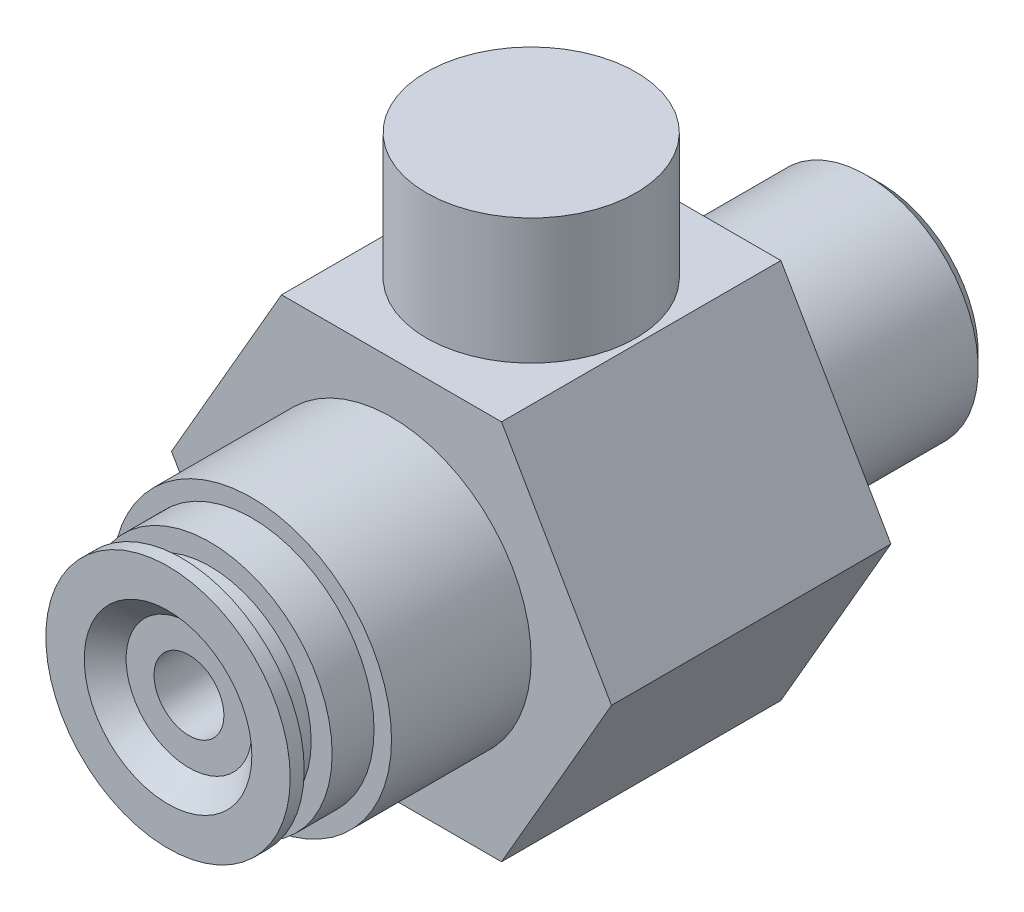
ISO-10303-21;
HEADER;
FILE_DESCRIPTION(('STEP AP214'),'2;1');
FILE_NAME('part.step','',(''),(''),'','','');
FILE_SCHEMA(('AUTOMOTIVE_DESIGN { 1 0 10303 214 1 1 1 1 }'));
ENDSEC;
DATA;
#1=APPLICATION_CONTEXT('core data for automotive mechanical design processes');
#2=APPLICATION_PROTOCOL_DEFINITION('international standard','automotive_design',2000,#1);
#3=PRODUCT_CONTEXT('',#1,'mechanical');
#4=PRODUCT('Part','Part','',(#3));
#5=PRODUCT_RELATED_PRODUCT_CATEGORY('part','',(#4));
#6=PRODUCT_DEFINITION_FORMATION('','',#4);
#7=PRODUCT_DEFINITION_CONTEXT('part definition',#1,'design');
#8=PRODUCT_DEFINITION('design','',#6,#7);
#9=PRODUCT_DEFINITION_SHAPE('','',#8);
#10=(LENGTH_UNIT() NAMED_UNIT(*) SI_UNIT(.MILLI.,.METRE.));
#11=(NAMED_UNIT(*) PLANE_ANGLE_UNIT() SI_UNIT($,.RADIAN.));
#12=(NAMED_UNIT(*) SI_UNIT($,.STERADIAN.) SOLID_ANGLE_UNIT());
#13=UNCERTAINTY_MEASURE_WITH_UNIT(LENGTH_MEASURE(1.E-05),#10,'distance_accuracy_value','');
#14=(GEOMETRIC_REPRESENTATION_CONTEXT(3) GLOBAL_UNCERTAINTY_ASSIGNED_CONTEXT((#13)) GLOBAL_UNIT_ASSIGNED_CONTEXT((#10,
#11,#12)) REPRESENTATION_CONTEXT('',''));
#15=CARTESIAN_POINT('',(0.,0.,0.));
#16=DIRECTION('',(0.,0.,1.));
#17=DIRECTION('',(1.,0.,0.));
#18=AXIS2_PLACEMENT_3D('',#15,#16,#17);
#19=CARTESIAN_POINT('',(0.,-17.6399001096049,10.));
#20=DIRECTION('',(0.,1.,0.));
#21=DIRECTION('',(-1.,0.,0.));
#22=AXIS2_PLACEMENT_3D('',#19,#20,#21);
#23=CYLINDRICAL_SURFACE('',#22,4.);
#24=CARTESIAN_POINT('',(0.,-17.6399001096049,10.));
#25=DIRECTION('',(0.,-1.,0.));
#26=DIRECTION('',(1.,0.,0.));
#27=AXIS2_PLACEMENT_3D('',#24,#25,#26);
#28=CIRCLE('',#27,4.);
#29=CARTESIAN_POINT('',(-2.99999999999993,-17.6399001096049,7.35424868893541));
#30=VERTEX_POINT('',#29);
#31=CARTESIAN_POINT('',(3.00000000000007,-17.6399001096049,7.35424868893541));
#32=VERTEX_POINT('',#31);
#33=EDGE_CURVE('E128',#30,#32,#28,.T.);
#34=ORIENTED_EDGE('',*,*,#33,.F.);
#35=DIRECTION('',(0.,-1.,0.));
#36=VECTOR('',#35,1.);
#37=CARTESIAN_POINT('',(-2.99999999999995,-13.6399001096049,7.35424868893541));
#38=LINE('',#37,#36);
#39=CARTESIAN_POINT('',(-2.99999999999995,-13.6399001096049,7.35424868893541));
#40=VERTEX_POINT('',#39);
#41=EDGE_CURVE('E52',#40,#30,#38,.T.);
#42=ORIENTED_EDGE('',*,*,#41,.F.);
#43=CARTESIAN_POINT('',(0.,-13.6399001096049,10.));
#44=DIRECTION('',(0.,-1.,0.));
#45=DIRECTION('',(1.,0.,0.));
#46=AXIS2_PLACEMENT_3D('',#43,#44,#45);
#47=CIRCLE('',#46,4.);
#48=CARTESIAN_POINT('',(3.00000000000005,-13.6399001096049,7.35424868893541));
#49=VERTEX_POINT('',#48);
#50=EDGE_CURVE('E126',#40,#49,#47,.T.);
#51=ORIENTED_EDGE('',*,*,#50,.T.);
#52=DIRECTION('',(0.,-1.,0.));
#53=VECTOR('',#52,1.);
#54=CARTESIAN_POINT('',(3.00000000000005,-13.6399001096049,7.35424868893541));
#55=LINE('',#54,#53);
#56=EDGE_CURVE('E529',#49,#32,#55,.T.);
#57=ORIENTED_EDGE('',*,*,#56,.T.);
#58=EDGE_LOOP('',(#34,#42,#51,#57));
#59=FACE_BOUND('',#58,.T.);
#60=ADVANCED_FACE('F37',(#59),#23,.T.);
#61=CARTESIAN_POINT('',(3.00000000000005,-13.6399001096049,12.6457513110646));
#62=VERTEX_POINT('',#61);
#63=CARTESIAN_POINT('',(-2.99999999999995,-13.6399001096049,12.6457513110646));
#64=VERTEX_POINT('',#63);
#65=EDGE_CURVE('E134',#62,#64,#47,.T.);
#66=ORIENTED_EDGE('',*,*,#65,.T.);
#67=DIRECTION('',(0.,-1.,0.));
#68=VECTOR('',#67,1.);
#69=CARTESIAN_POINT('',(-2.99999999999995,-13.6399001096049,12.6457513110646));
#70=LINE('',#69,#68);
#71=CARTESIAN_POINT('',(-2.99999999999993,-17.6399001096049,12.6457513110646));
#72=VERTEX_POINT('',#71);
#73=EDGE_CURVE('E115',#64,#72,#70,.T.);
#74=ORIENTED_EDGE('',*,*,#73,.T.);
#75=CARTESIAN_POINT('',(3.00000000000007,-17.6399001096049,12.6457513110646));
#76=VERTEX_POINT('',#75);
#77=EDGE_CURVE('E143',#76,#72,#28,.T.);
#78=ORIENTED_EDGE('',*,*,#77,.F.);
#79=DIRECTION('',(0.,-1.,0.));
#80=VECTOR('',#79,1.);
#81=CARTESIAN_POINT('',(3.00000000000005,-13.6399001096049,12.6457513110646));
#82=LINE('',#81,#80);
#83=EDGE_CURVE('E60',#62,#76,#82,.T.);
#84=ORIENTED_EDGE('',*,*,#83,.F.);
#85=EDGE_LOOP('',(#66,#74,#78,#84));
#86=FACE_BOUND('',#85,.T.);
#87=ADVANCED_FACE('F242',(#86),#23,.T.);
#88=CARTESIAN_POINT('',(0.,-17.6399001096049,10.));
#89=DIRECTION('',(0.,-1.,0.));
#90=DIRECTION('',(1.,0.,0.));
#91=AXIS2_PLACEMENT_3D('',#88,#89,#90);
#92=PLANE('',#91);
#93=DIRECTION('',(0.,0.,1.));
#94=VECTOR('',#93,1.);
#95=CARTESIAN_POINT('',(-2.99999999999993,-17.6399001096049,0.));
#96=LINE('',#95,#94);
#97=EDGE_CURVE('E120',#30,#72,#96,.T.);
#98=ORIENTED_EDGE('',*,*,#97,.F.);
#99=ORIENTED_EDGE('',*,*,#33,.T.);
#100=DIRECTION('',(0.,0.,1.));
#101=VECTOR('',#100,1.);
#102=CARTESIAN_POINT('',(3.00000000000007,-17.6399001096049,0.));
#103=LINE('',#102,#101);
#104=EDGE_CURVE('E535',#32,#76,#103,.T.);
#105=ORIENTED_EDGE('',*,*,#104,.T.);
#106=ORIENTED_EDGE('',*,*,#77,.T.);
#107=EDGE_LOOP('',(#98,#99,#105,#106));
#108=FACE_BOUND('',#107,.T.);
#109=ADVANCED_FACE('F247',(#108),#92,.T.);
#110=CARTESIAN_POINT('',(0.,0.,36.));
#111=DIRECTION('',(0.,0.,-1.));
#112=DIRECTION('',(-1.,0.,0.));
#113=AXIS2_PLACEMENT_3D('',#110,#111,#112);
#114=CYLINDRICAL_SURFACE('',#113,8.75);
#115=CARTESIAN_POINT('',(0.,0.,36.));
#116=DIRECTION('',(0.,0.,1.));
#117=DIRECTION('',(1.,0.,0.));
#118=AXIS2_PLACEMENT_3D('',#115,#116,#117);
#119=CIRCLE('',#118,8.75);
#120=CARTESIAN_POINT('',(8.75,0.,36.));
#121=VERTEX_POINT('',#120);
#122=EDGE_CURVE('E169',#121,#121,#119,.T.);
#123=ORIENTED_EDGE('',*,*,#122,.F.);
#124=EDGE_LOOP('',(#123));
#125=FACE_BOUND('',#124,.T.);
#126=CARTESIAN_POINT('',(0.,0.,35.));
#127=DIRECTION('',(0.,0.,1.));
#128=DIRECTION('',(1.,0.,0.));
#129=AXIS2_PLACEMENT_3D('',#126,#127,#128);
#130=CIRCLE('',#129,8.75);
#131=CARTESIAN_POINT('',(8.75,0.,35.));
#132=VERTEX_POINT('',#131);
#133=EDGE_CURVE('E154',#132,#132,#130,.T.);
#134=ORIENTED_EDGE('',*,*,#133,.T.);
#135=EDGE_LOOP('',(#134));
#136=FACE_BOUND('',#135,.T.);
#137=ADVANCED_FACE('F283',(#125,#136),#114,.T.);
#138=CARTESIAN_POINT('',(0.,0.,36.));
#139=DIRECTION('',(0.,0.,1.));
#140=DIRECTION('',(1.,0.,0.));
#141=AXIS2_PLACEMENT_3D('',#138,#139,#140);
#142=PLANE('',#141);
#143=CARTESIAN_POINT('',(0.,0.,36.));
#144=DIRECTION('',(0.,0.,1.));
#145=DIRECTION('',(1.,0.,0.));
#146=AXIS2_PLACEMENT_3D('',#143,#144,#145);
#147=CIRCLE('',#146,6.);
#148=CARTESIAN_POINT('',(6.,0.,36.));
#149=VERTEX_POINT('',#148);
#150=EDGE_CURVE('E166',#149,#149,#147,.T.);
#151=ORIENTED_EDGE('',*,*,#150,.F.);
#152=EDGE_LOOP('',(#151));
#153=FACE_BOUND('',#152,.T.);
#154=ORIENTED_EDGE('',*,*,#122,.T.);
#155=EDGE_LOOP('',(#154));
#156=FACE_BOUND('',#155,.T.);
#157=ADVANCED_FACE('F279',(#153,#156),#142,.T.);
#158=CARTESIAN_POINT('',(0.,0.,34.5));
#159=DIRECTION('',(0.,0.,1.));
#160=DIRECTION('',(1.,0.,0.));
#161=AXIS2_PLACEMENT_3D('',#158,#159,#160);
#162=CONICAL_SURFACE('',#161,4.5,0.785398163397449);
#163=ORIENTED_EDGE('',*,*,#150,.T.);
#164=EDGE_LOOP('',(#163));
#165=FACE_BOUND('',#164,.T.);
#166=CARTESIAN_POINT('',(0.,0.,34.5));
#167=DIRECTION('',(0.,0.,1.));
#168=DIRECTION('',(1.,0.,0.));
#169=AXIS2_PLACEMENT_3D('',#166,#167,#168);
#170=CIRCLE('',#169,4.5);
#171=CARTESIAN_POINT('',(4.5,0.,34.5));
#172=VERTEX_POINT('',#171);
#173=EDGE_CURVE('E161',#172,#172,#170,.T.);
#174=ORIENTED_EDGE('',*,*,#173,.F.);
#175=EDGE_LOOP('',(#174));
#176=FACE_BOUND('',#175,.T.);
#177=ADVANCED_FACE('F275',(#165,#176),#162,.F.);
#178=CARTESIAN_POINT('',(-4.5,0.,34.5));
#179=DIRECTION('',(0.,0.,1.));
#180=DIRECTION('',(1.,0.,0.));
#181=AXIS2_PLACEMENT_3D('',#178,#179,#180);
#182=PLANE('',#181);
#183=CARTESIAN_POINT('',(0.,0.,34.5));
#184=DIRECTION('',(0.,0.,1.));
#185=DIRECTION('',(1.,0.,0.));
#186=AXIS2_PLACEMENT_3D('',#183,#184,#185);
#187=CIRCLE('',#186,2.5);
#188=CARTESIAN_POINT('',(2.5,0.,34.5));
#189=VERTEX_POINT('',#188);
#190=EDGE_CURVE('E157',#189,#189,#187,.T.);
#191=ORIENTED_EDGE('',*,*,#190,.F.);
#192=EDGE_LOOP('',(#191));
#193=FACE_BOUND('',#192,.T.);
#194=ORIENTED_EDGE('',*,*,#173,.T.);
#195=EDGE_LOOP('',(#194));
#196=FACE_BOUND('',#195,.T.);
#197=ADVANCED_FACE('F271',(#193,#196),#182,.T.);
#198=CARTESIAN_POINT('',(0.,0.,16.));
#199=DIRECTION('',(0.,0.,1.));
#200=DIRECTION('',(1.,0.,0.));
#201=AXIS2_PLACEMENT_3D('',#198,#199,#200);
#202=CYLINDRICAL_SURFACE('',#201,2.5);
#203=CARTESIAN_POINT('',(0.,0.,16.));
#204=DIRECTION('',(0.,0.,1.));
#205=DIRECTION('',(1.,0.,0.));
#206=AXIS2_PLACEMENT_3D('',#203,#204,#205);
#207=CIRCLE('',#206,2.5);
#208=CARTESIAN_POINT('',(2.5,0.,16.));
#209=VERTEX_POINT('',#208);
#210=EDGE_CURVE('E158',#209,#209,#207,.T.);
#211=ORIENTED_EDGE('',*,*,#210,.F.);
#212=EDGE_LOOP('',(#211));
#213=FACE_BOUND('',#212,.T.);
#214=ORIENTED_EDGE('',*,*,#190,.T.);
#215=EDGE_LOOP('',(#214));
#216=FACE_BOUND('',#215,.T.);
#217=ADVANCED_FACE('F267',(#213,#216),#202,.F.);
#218=CARTESIAN_POINT('',(0.,0.,16.));
#219=DIRECTION('',(0.,0.,1.));
#220=DIRECTION('',(1.,0.,0.));
#221=AXIS2_PLACEMENT_3D('',#218,#219,#220);
#222=PLANE('',#221);
#223=ORIENTED_EDGE('',*,*,#210,.T.);
#224=EDGE_LOOP('',(#223));
#225=FACE_BOUND('',#224,.T.);
#226=ADVANCED_FACE('F263',(#225),#222,.T.);
#227=CARTESIAN_POINT('',(-8.75,0.,35.));
#228=DIRECTION('',(0.,0.,-1.));
#229=DIRECTION('',(-1.,0.,0.));
#230=AXIS2_PLACEMENT_3D('',#227,#228,#229);
#231=PLANE('',#230);
#232=CARTESIAN_POINT('',(0.,0.,35.));
#233=DIRECTION('',(0.,0.,1.));
#234=DIRECTION('',(1.,0.,0.));
#235=AXIS2_PLACEMENT_3D('',#232,#233,#234);
#236=CIRCLE('',#235,7.25);
#237=CARTESIAN_POINT('',(7.25,0.,35.));
#238=VERTEX_POINT('',#237);
#239=EDGE_CURVE('E151',#238,#238,#236,.T.);
#240=ORIENTED_EDGE('',*,*,#239,.T.);
#241=EDGE_LOOP('',(#240));
#242=FACE_BOUND('',#241,.T.);
#243=ORIENTED_EDGE('',*,*,#133,.F.);
#244=EDGE_LOOP('',(#243));
#245=FACE_BOUND('',#244,.T.);
#246=ADVANCED_FACE('F259',(#242,#245),#231,.T.);
#247=CARTESIAN_POINT('',(0.,0.,40.6572682242887));
#248=DIRECTION('',(0.,0.,1.));
#249=DIRECTION('',(1.,0.,0.));
#250=AXIS2_PLACEMENT_3D('',#247,#248,#249);
#251=CYLINDRICAL_SURFACE('',#250,7.25);
#252=CARTESIAN_POINT('',(0.,0.,33.));
#253=DIRECTION('',(0.,0.,1.));
#254=DIRECTION('',(1.,0.,0.));
#255=AXIS2_PLACEMENT_3D('',#252,#253,#254);
#256=CIRCLE('',#255,7.25);
#257=CARTESIAN_POINT('',(7.25,0.,33.));
#258=VERTEX_POINT('',#257);
#259=EDGE_CURVE('E148',#258,#258,#256,.T.);
#260=ORIENTED_EDGE('',*,*,#259,.T.);
#261=EDGE_LOOP('',(#260));
#262=FACE_BOUND('',#261,.T.);
#263=ORIENTED_EDGE('',*,*,#239,.F.);
#264=EDGE_LOOP('',(#263));
#265=FACE_BOUND('',#264,.T.);
#266=ADVANCED_FACE('F255',(#262,#265),#251,.T.);
#267=CARTESIAN_POINT('',(-7.25,0.,33.));
#268=DIRECTION('',(0.,0.,1.));
#269=DIRECTION('',(1.,0.,0.));
#270=AXIS2_PLACEMENT_3D('',#267,#268,#269);
#271=PLANE('',#270);
#272=CARTESIAN_POINT('',(0.,0.,33.));
#273=DIRECTION('',(0.,0.,1.));
#274=DIRECTION('',(1.,0.,0.));
#275=AXIS2_PLACEMENT_3D('',#272,#273,#274);
#276=CIRCLE('',#275,8.75);
#277=CARTESIAN_POINT('',(8.75,0.,33.));
#278=VERTEX_POINT('',#277);
#279=EDGE_CURVE('E145',#278,#278,#276,.T.);
#280=ORIENTED_EDGE('',*,*,#279,.T.);
#281=EDGE_LOOP('',(#280));
#282=FACE_BOUND('',#281,.T.);
#283=ORIENTED_EDGE('',*,*,#259,.F.);
#284=EDGE_LOOP('',(#283));
#285=FACE_BOUND('',#284,.T.);
#286=ADVANCED_FACE('F252',(#282,#285),#271,.T.);
#287=CARTESIAN_POINT('',(0.,0.,0.));
#288=DIRECTION('',(0.,0.,-1.));
#289=DIRECTION('',(-1.,0.,0.));
#290=AXIS2_PLACEMENT_3D('',#287,#288,#289);
#291=PLANE('',#290);
#292=CARTESIAN_POINT('',(0.,0.,0.));
#293=DIRECTION('',(0.,0.,-1.));
#294=DIRECTION('',(-1.,0.,0.));
#295=AXIS2_PLACEMENT_3D('',#292,#293,#294);
#296=CIRCLE('',#295,8.);
#297=CARTESIAN_POINT('',(-8.,0.,0.));
#298=VERTEX_POINT('',#297);
#299=EDGE_CURVE('E538',#298,#298,#296,.T.);
#300=ORIENTED_EDGE('',*,*,#299,.F.);
#301=EDGE_LOOP('',(#300));
#302=FACE_BOUND('',#301,.T.);
#303=DIRECTION('',(-0.500000000000001,-0.866025403784438,0.));
#304=VECTOR('',#303,1.);
#305=CARTESIAN_POINT('',(-15.75,0.,0.));
#306=LINE('',#305,#304);
#307=CARTESIAN_POINT('',(-7.87499999999997,13.6399001096049,0.));
#308=VERTEX_POINT('',#307);
#309=CARTESIAN_POINT('',(-15.75,0.,0.));
#310=VERTEX_POINT('',#309);
#311=EDGE_CURVE('E175',#308,#310,#306,.T.);
#312=ORIENTED_EDGE('',*,*,#311,.F.);
#313=DIRECTION('',(-1.,0.,0.));
#314=VECTOR('',#313,1.);
#315=CARTESIAN_POINT('',(-7.87499999999997,13.6399001096049,0.));
#316=LINE('',#315,#314);
#317=CARTESIAN_POINT('',(7.87499999999997,13.6399001096049,0.));
#318=VERTEX_POINT('',#317);
#319=EDGE_CURVE('E183',#318,#308,#316,.T.);
#320=ORIENTED_EDGE('',*,*,#319,.F.);
#321=DIRECTION('',(-0.500000000000001,0.866025403784438,0.));
#322=VECTOR('',#321,1.);
#323=CARTESIAN_POINT('',(7.87499999999997,13.6399001096049,0.));
#324=LINE('',#323,#322);
#325=CARTESIAN_POINT('',(15.75,0.,0.));
#326=VERTEX_POINT('',#325);
#327=EDGE_CURVE('E202',#326,#318,#324,.T.);
#328=ORIENTED_EDGE('',*,*,#327,.F.);
#329=DIRECTION('',(0.499999999999998,0.86602540378444,0.));
#330=VECTOR('',#329,1.);
#331=CARTESIAN_POINT('',(15.75,0.,0.));
#332=LINE('',#331,#330);
#333=CARTESIAN_POINT('',(7.87500000000007,-13.6399001096049,0.));
#334=VERTEX_POINT('',#333);
#335=EDGE_CURVE('E200',#334,#326,#332,.T.);
#336=ORIENTED_EDGE('',*,*,#335,.F.);
#337=DIRECTION('',(1.,0.,0.));
#338=VECTOR('',#337,1.);
#339=CARTESIAN_POINT('',(7.87500000000007,-13.6399001096049,0.));
#340=LINE('',#339,#338);
#341=CARTESIAN_POINT('',(-7.87499999999996,-13.6399001096049,0.));
#342=VERTEX_POINT('',#341);
#343=EDGE_CURVE('E198',#342,#334,#340,.T.);
#344=ORIENTED_EDGE('',*,*,#343,.F.);
#345=DIRECTION('',(0.500000000000001,-0.866025403784438,0.));
#346=VECTOR('',#345,1.);
#347=CARTESIAN_POINT('',(-7.87499999999996,-13.6399001096049,0.));
#348=LINE('',#347,#346);
#349=EDGE_CURVE('E196',#310,#342,#348,.T.);
#350=ORIENTED_EDGE('',*,*,#349,.F.);
#351=EDGE_LOOP('',(#312,#320,#328,#336,#344,#350));
#352=FACE_BOUND('',#351,.T.);
#353=ADVANCED_FACE('F239',(#302,#352),#291,.T.);
#354=CARTESIAN_POINT('',(-7.87499999999997,13.6399001096049,20.));
#355=DIRECTION('',(0.,-1.,0.));
#356=DIRECTION('',(0.,0.,-1.));
#357=AXIS2_PLACEMENT_3D('',#354,#355,#356);
#358=PLANE('',#357);
#359=CARTESIAN_POINT('',(0.,13.6399001096049,10.));
#360=DIRECTION('',(0.,1.,0.));
#361=DIRECTION('',(0.,0.,1.));
#362=AXIS2_PLACEMENT_3D('',#359,#360,#361);
#363=CIRCLE('',#362,7.5);
#364=CARTESIAN_POINT('',(0.,13.6399001096049,17.5));
#365=VERTEX_POINT('',#364);
#366=EDGE_CURVE('E137',#365,#365,#363,.T.);
#367=ORIENTED_EDGE('',*,*,#366,.F.);
#368=EDGE_LOOP('',(#367));
#369=FACE_BOUND('',#368,.T.);
#370=ORIENTED_EDGE('',*,*,#319,.T.);
#371=DIRECTION('',(0.,0.,-1.));
#372=VECTOR('',#371,1.);
#373=CARTESIAN_POINT('',(-7.87499999999997,13.6399001096049,20.));
#374=LINE('',#373,#372);
#375=CARTESIAN_POINT('',(-7.87499999999997,13.6399001096049,20.));
#376=VERTEX_POINT('',#375);
#377=EDGE_CURVE('E193',#376,#308,#374,.T.);
#378=ORIENTED_EDGE('',*,*,#377,.F.);
#379=DIRECTION('',(-1.,0.,0.));
#380=VECTOR('',#379,1.);
#381=CARTESIAN_POINT('',(-7.87499999999997,13.6399001096049,20.));
#382=LINE('',#381,#380);
#383=CARTESIAN_POINT('',(7.87499999999997,13.6399001096049,20.));
#384=VERTEX_POINT('',#383);
#385=EDGE_CURVE('E191',#384,#376,#382,.T.);
#386=ORIENTED_EDGE('',*,*,#385,.F.);
#387=DIRECTION('',(0.,0.,-1.));
#388=VECTOR('',#387,1.);
#389=CARTESIAN_POINT('',(7.87499999999997,13.6399001096049,20.));
#390=LINE('',#389,#388);
#391=EDGE_CURVE('E207',#384,#318,#390,.T.);
#392=ORIENTED_EDGE('',*,*,#391,.T.);
#393=EDGE_LOOP('',(#370,#378,#386,#392));
#394=FACE_BOUND('',#393,.T.);
#395=ADVANCED_FACE('F303',(#369,#394),#358,.F.);
#396=CARTESIAN_POINT('',(7.87499999999997,13.6399001096049,20.));
#397=DIRECTION('',(-0.866025403784438,-0.500000000000001,0.));
#398=DIRECTION('',(0.500000000000001,-0.866025403784438,0.));
#399=AXIS2_PLACEMENT_3D('',#396,#397,#398);
#400=PLANE('',#399);
#401=ORIENTED_EDGE('',*,*,#327,.T.);
#402=ORIENTED_EDGE('',*,*,#391,.F.);
#403=DIRECTION('',(-0.500000000000001,0.866025403784438,0.));
#404=VECTOR('',#403,1.);
#405=CARTESIAN_POINT('',(7.87499999999997,13.6399001096049,20.));
#406=LINE('',#405,#404);
#407=CARTESIAN_POINT('',(15.75,0.,20.));
#408=VERTEX_POINT('',#407);
#409=EDGE_CURVE('E189',#408,#384,#406,.T.);
#410=ORIENTED_EDGE('',*,*,#409,.F.);
#411=DIRECTION('',(0.,0.,-1.));
#412=VECTOR('',#411,1.);
#413=CARTESIAN_POINT('',(15.75,0.,20.));
#414=LINE('',#413,#412);
#415=EDGE_CURVE('E210',#408,#326,#414,.T.);
#416=ORIENTED_EDGE('',*,*,#415,.T.);
#417=EDGE_LOOP('',(#401,#402,#410,#416));
#418=FACE_BOUND('',#417,.T.);
#419=ADVANCED_FACE('F307',(#418),#400,.F.);
#420=CARTESIAN_POINT('',(15.75,0.,20.));
#421=DIRECTION('',(-0.86602540378444,0.499999999999998,0.));
#422=DIRECTION('',(-0.499999999999998,-0.86602540378444,0.));
#423=AXIS2_PLACEMENT_3D('',#420,#421,#422);
#424=PLANE('',#423);
#425=ORIENTED_EDGE('',*,*,#335,.T.);
#426=ORIENTED_EDGE('',*,*,#415,.F.);
#427=DIRECTION('',(0.499999999999998,0.86602540378444,0.));
#428=VECTOR('',#427,1.);
#429=CARTESIAN_POINT('',(15.75,0.,20.));
#430=LINE('',#429,#428);
#431=CARTESIAN_POINT('',(7.87500000000007,-13.6399001096049,20.));
#432=VERTEX_POINT('',#431);
#433=EDGE_CURVE('E187',#432,#408,#430,.T.);
#434=ORIENTED_EDGE('',*,*,#433,.F.);
#435=DIRECTION('',(0.,0.,-1.));
#436=VECTOR('',#435,1.);
#437=CARTESIAN_POINT('',(7.87500000000007,-13.6399001096049,20.));
#438=LINE('',#437,#436);
#439=EDGE_CURVE('E213',#432,#334,#438,.T.);
#440=ORIENTED_EDGE('',*,*,#439,.T.);
#441=EDGE_LOOP('',(#425,#426,#434,#440));
#442=FACE_BOUND('',#441,.T.);
#443=ADVANCED_FACE('F311',(#442),#424,.F.);
#444=CARTESIAN_POINT('',(7.87500000000007,-13.6399001096049,20.));
#445=DIRECTION('',(0.,1.,0.));
#446=DIRECTION('',(-1.,0.,0.));
#447=AXIS2_PLACEMENT_3D('',#444,#445,#446);
#448=PLANE('',#447);
#449=ORIENTED_EDGE('',*,*,#65,.F.);
#450=DIRECTION('',(0.,0.,1.));
#451=VECTOR('',#450,1.);
#452=CARTESIAN_POINT('',(3.00000000000005,-13.6399001096049,0.));
#453=LINE('',#452,#451);
#454=EDGE_CURVE('E133',#49,#62,#453,.T.);
#455=ORIENTED_EDGE('',*,*,#454,.F.);
#456=ORIENTED_EDGE('',*,*,#50,.F.);
#457=DIRECTION('',(0.,0.,1.));
#458=VECTOR('',#457,1.);
#459=CARTESIAN_POINT('',(-2.99999999999995,-13.6399001096049,0.));
#460=LINE('',#459,#458);
#461=EDGE_CURVE('E112',#40,#64,#460,.T.);
#462=ORIENTED_EDGE('',*,*,#461,.T.);
#463=EDGE_LOOP('',(#449,#455,#456,#462));
#464=FACE_BOUND('',#463,.T.);
#465=ORIENTED_EDGE('',*,*,#343,.T.);
#466=ORIENTED_EDGE('',*,*,#439,.F.);
#467=DIRECTION('',(1.,0.,0.));
#468=VECTOR('',#467,1.);
#469=CARTESIAN_POINT('',(7.87500000000007,-13.6399001096049,20.));
#470=LINE('',#469,#468);
#471=CARTESIAN_POINT('',(-7.87499999999996,-13.6399001096049,20.));
#472=VERTEX_POINT('',#471);
#473=EDGE_CURVE('E185',#472,#432,#470,.T.);
#474=ORIENTED_EDGE('',*,*,#473,.F.);
#475=DIRECTION('',(0.,0.,-1.));
#476=VECTOR('',#475,1.);
#477=CARTESIAN_POINT('',(-7.87499999999996,-13.6399001096049,20.));
#478=LINE('',#477,#476);
#479=EDGE_CURVE('E216',#472,#342,#478,.T.);
#480=ORIENTED_EDGE('',*,*,#479,.T.);
#481=EDGE_LOOP('',(#465,#466,#474,#480));
#482=FACE_BOUND('',#481,.T.);
#483=ADVANCED_FACE('F131',(#464,#482),#448,.F.);
#484=CARTESIAN_POINT('',(-7.87499999999996,-13.6399001096049,20.));
#485=DIRECTION('',(0.866025403784438,0.500000000000001,0.));
#486=DIRECTION('',(-0.500000000000001,0.866025403784438,0.));
#487=AXIS2_PLACEMENT_3D('',#484,#485,#486);
#488=PLANE('',#487);
#489=ORIENTED_EDGE('',*,*,#349,.T.);
#490=ORIENTED_EDGE('',*,*,#479,.F.);
#491=DIRECTION('',(0.500000000000001,-0.866025403784438,0.));
#492=VECTOR('',#491,1.);
#493=CARTESIAN_POINT('',(-7.87499999999996,-13.6399001096049,20.));
#494=LINE('',#493,#492);
#495=CARTESIAN_POINT('',(-15.75,0.,20.));
#496=VERTEX_POINT('',#495);
#497=EDGE_CURVE('E182',#496,#472,#494,.T.);
#498=ORIENTED_EDGE('',*,*,#497,.F.);
#499=DIRECTION('',(0.,0.,-1.));
#500=VECTOR('',#499,1.);
#501=CARTESIAN_POINT('',(-15.75,0.,20.));
#502=LINE('',#501,#500);
#503=EDGE_CURVE('E178',#496,#310,#502,.T.);
#504=ORIENTED_EDGE('',*,*,#503,.T.);
#505=EDGE_LOOP('',(#489,#490,#498,#504));
#506=FACE_BOUND('',#505,.T.);
#507=ADVANCED_FACE('F318',(#506),#488,.F.);
#508=CARTESIAN_POINT('',(-15.75,0.,20.));
#509=DIRECTION('',(0.866025403784438,-0.500000000000001,0.));
#510=DIRECTION('',(0.500000000000001,0.866025403784438,0.));
#511=AXIS2_PLACEMENT_3D('',#508,#509,#510);
#512=PLANE('',#511);
#513=ORIENTED_EDGE('',*,*,#311,.T.);
#514=ORIENTED_EDGE('',*,*,#503,.F.);
#515=DIRECTION('',(-0.500000000000001,-0.866025403784438,0.));
#516=VECTOR('',#515,1.);
#517=CARTESIAN_POINT('',(-15.75,0.,20.));
#518=LINE('',#517,#516);
#519=EDGE_CURVE('E179',#376,#496,#518,.T.);
#520=ORIENTED_EDGE('',*,*,#519,.F.);
#521=ORIENTED_EDGE('',*,*,#377,.T.);
#522=EDGE_LOOP('',(#513,#514,#520,#521));
#523=FACE_BOUND('',#522,.T.);
#524=ADVANCED_FACE('F299',(#523),#512,.F.);
#525=CARTESIAN_POINT('',(0.,0.,20.));
#526=DIRECTION('',(0.,0.,-1.));
#527=DIRECTION('',(-1.,0.,0.));
#528=AXIS2_PLACEMENT_3D('',#525,#526,#527);
#529=PLANE('',#528);
#530=CARTESIAN_POINT('',(0.,0.,20.));
#531=DIRECTION('',(0.,0.,1.));
#532=DIRECTION('',(1.,0.,0.));
#533=AXIS2_PLACEMENT_3D('',#530,#531,#532);
#534=CIRCLE('',#533,10.);
#535=CARTESIAN_POINT('',(10.,0.,20.));
#536=VERTEX_POINT('',#535);
#537=EDGE_CURVE('E139',#536,#536,#534,.T.);
#538=ORIENTED_EDGE('',*,*,#537,.F.);
#539=EDGE_LOOP('',(#538));
#540=FACE_BOUND('',#539,.T.);
#541=ORIENTED_EDGE('',*,*,#519,.T.);
#542=ORIENTED_EDGE('',*,*,#497,.T.);
#543=ORIENTED_EDGE('',*,*,#473,.T.);
#544=ORIENTED_EDGE('',*,*,#433,.T.);
#545=ORIENTED_EDGE('',*,*,#409,.T.);
#546=ORIENTED_EDGE('',*,*,#385,.T.);
#547=EDGE_LOOP('',(#541,#542,#543,#544,#545,#546));
#548=FACE_BOUND('',#547,.T.);
#549=ADVANCED_FACE('F296',(#540,#548),#529,.F.);
#550=CARTESIAN_POINT('',(0.,0.,30.));
#551=DIRECTION('',(0.,0.,-1.));
#552=DIRECTION('',(-1.,0.,0.));
#553=AXIS2_PLACEMENT_3D('',#550,#551,#552);
#554=CYLINDRICAL_SURFACE('',#553,10.);
#555=CARTESIAN_POINT('',(0.,0.,30.));
#556=DIRECTION('',(0.,0.,1.));
#557=DIRECTION('',(1.,0.,0.));
#558=AXIS2_PLACEMENT_3D('',#555,#556,#557);
#559=CIRCLE('',#558,10.);
#560=CARTESIAN_POINT('',(10.,0.,30.));
#561=VERTEX_POINT('',#560);
#562=EDGE_CURVE('E171',#561,#561,#559,.T.);
#563=ORIENTED_EDGE('',*,*,#562,.F.);
#564=EDGE_LOOP('',(#563));
#565=FACE_BOUND('',#564,.T.);
#566=ORIENTED_EDGE('',*,*,#537,.T.);
#567=EDGE_LOOP('',(#566));
#568=FACE_BOUND('',#567,.T.);
#569=ADVANCED_FACE('F292',(#565,#568),#554,.T.);
#570=CARTESIAN_POINT('',(0.,0.,30.));
#571=DIRECTION('',(0.,0.,1.));
#572=DIRECTION('',(1.,0.,0.));
#573=AXIS2_PLACEMENT_3D('',#570,#571,#572);
#574=PLANE('',#573);
#575=CARTESIAN_POINT('',(0.,0.,30.));
#576=DIRECTION('',(0.,0.,1.));
#577=DIRECTION('',(1.,0.,0.));
#578=AXIS2_PLACEMENT_3D('',#575,#576,#577);
#579=CIRCLE('',#578,8.75);
#580=CARTESIAN_POINT('',(8.75,0.,30.));
#581=VERTEX_POINT('',#580);
#582=EDGE_CURVE('E135',#581,#581,#579,.T.);
#583=ORIENTED_EDGE('',*,*,#582,.F.);
#584=EDGE_LOOP('',(#583));
#585=FACE_BOUND('',#584,.T.);
#586=ORIENTED_EDGE('',*,*,#562,.T.);
#587=EDGE_LOOP('',(#586));
#588=FACE_BOUND('',#587,.T.);
#589=ADVANCED_FACE('F289',(#585,#588),#574,.T.);
#590=ORIENTED_EDGE('',*,*,#582,.T.);
#591=EDGE_LOOP('',(#590));
#592=FACE_BOUND('',#591,.T.);
#593=ORIENTED_EDGE('',*,*,#279,.F.);
#594=EDGE_LOOP('',(#593));
#595=FACE_BOUND('',#594,.T.);
#596=ADVANCED_FACE('F288',(#592,#595),#114,.T.);
#597=CARTESIAN_POINT('',(3.00000000000005,-13.6399001096049,0.));
#598=DIRECTION('',(1.,0.,0.));
#599=DIRECTION('',(0.,1.,0.));
#600=AXIS2_PLACEMENT_3D('',#597,#598,#599);
#601=PLANE('',#600);
#602=ORIENTED_EDGE('',*,*,#104,.F.);
#603=ORIENTED_EDGE('',*,*,#56,.F.);
#604=ORIENTED_EDGE('',*,*,#454,.T.);
#605=ORIENTED_EDGE('',*,*,#83,.T.);
#606=EDGE_LOOP('',(#602,#603,#604,#605));
#607=FACE_BOUND('',#606,.T.);
#608=ADVANCED_FACE('F366',(#607),#601,.T.);
#609=CARTESIAN_POINT('',(-2.99999999999995,-13.6399001096049,0.));
#610=DIRECTION('',(1.,0.,0.));
#611=DIRECTION('',(0.,1.,0.));
#612=AXIS2_PLACEMENT_3D('',#609,#610,#611);
#613=PLANE('',#612);
#614=ORIENTED_EDGE('',*,*,#97,.T.);
#615=ORIENTED_EDGE('',*,*,#73,.F.);
#616=ORIENTED_EDGE('',*,*,#461,.F.);
#617=ORIENTED_EDGE('',*,*,#41,.T.);
#618=EDGE_LOOP('',(#614,#615,#616,#617));
#619=FACE_BOUND('',#618,.T.);
#620=ADVANCED_FACE('F113',(#619),#613,.F.);
#621=CARTESIAN_POINT('',(0.,22.6399001096049,10.));
#622=DIRECTION('',(0.,-1.,0.));
#623=DIRECTION('',(0.,0.,-1.));
#624=AXIS2_PLACEMENT_3D('',#621,#622,#623);
#625=CYLINDRICAL_SURFACE('',#624,7.5);
#626=CARTESIAN_POINT('',(0.,22.6399001096049,10.));
#627=DIRECTION('',(0.,1.,0.));
#628=DIRECTION('',(0.,0.,1.));
#629=AXIS2_PLACEMENT_3D('',#626,#627,#628);
#630=CIRCLE('',#629,7.5);
#631=CARTESIAN_POINT('',(0.,22.6399001096049,17.5));
#632=VERTEX_POINT('',#631);
#633=EDGE_CURVE('E536',#632,#632,#630,.T.);
#634=ORIENTED_EDGE('',*,*,#633,.F.);
#635=EDGE_LOOP('',(#634));
#636=FACE_BOUND('',#635,.T.);
#637=ORIENTED_EDGE('',*,*,#366,.T.);
#638=EDGE_LOOP('',(#637));
#639=FACE_BOUND('',#638,.T.);
#640=ADVANCED_FACE('F380',(#636,#639),#625,.T.);
#641=CARTESIAN_POINT('',(0.,22.6399001096049,10.));
#642=DIRECTION('',(0.,1.,0.));
#643=DIRECTION('',(0.,0.,1.));
#644=AXIS2_PLACEMENT_3D('',#641,#642,#643);
#645=PLANE('',#644);
#646=ORIENTED_EDGE('',*,*,#633,.T.);
#647=EDGE_LOOP('',(#646));
#648=FACE_BOUND('',#647,.T.);
#649=ADVANCED_FACE('F388',(#648),#645,.T.);
#650=CARTESIAN_POINT('',(0.,0.,-15.));
#651=DIRECTION('',(0.,0.,-1.));
#652=DIRECTION('',(-1.,0.,0.));
#653=AXIS2_PLACEMENT_3D('',#650,#651,#652);
#654=PLANE('',#653);
#655=CARTESIAN_POINT('',(0.,0.,-15.));
#656=DIRECTION('',(0.,0.,-1.));
#657=DIRECTION('',(-1.,0.,0.));
#658=AXIS2_PLACEMENT_3D('',#655,#656,#657);
#659=CIRCLE('',#658,6.99999999999999);
#660=CARTESIAN_POINT('',(-6.99999999999999,0.,-15.));
#661=VERTEX_POINT('',#660);
#662=EDGE_CURVE('E45',#661,#661,#659,.T.);
#663=ORIENTED_EDGE('',*,*,#662,.T.);
#664=EDGE_LOOP('',(#663));
#665=FACE_BOUND('',#664,.T.);
#666=CARTESIAN_POINT('',(0.,0.,-15.));
#667=DIRECTION('',(0.,0.,-1.));
#668=DIRECTION('',(-1.,0.,0.));
#669=AXIS2_PLACEMENT_3D('',#666,#667,#668);
#670=CIRCLE('',#669,5.);
#671=CARTESIAN_POINT('',(-5.,0.,-15.));
#672=VERTEX_POINT('',#671);
#673=EDGE_CURVE('E542',#672,#672,#670,.T.);
#674=ORIENTED_EDGE('',*,*,#673,.F.);
#675=EDGE_LOOP('',(#674));
#676=FACE_BOUND('',#675,.T.);
#677=ADVANCED_FACE('F226',(#665,#676),#654,.T.);
#678=CARTESIAN_POINT('',(0.,0.,-15.));
#679=DIRECTION('',(0.,0.,1.));
#680=DIRECTION('',(1.,0.,0.));
#681=AXIS2_PLACEMENT_3D('',#678,#679,#680);
#682=CYLINDRICAL_SURFACE('',#681,8.);
#683=CARTESIAN_POINT('',(0.,0.,-14.));
#684=DIRECTION('',(0.,0.,-1.));
#685=DIRECTION('',(-1.,0.,0.));
#686=AXIS2_PLACEMENT_3D('',#683,#684,#685);
#687=CIRCLE('',#686,8.);
#688=CARTESIAN_POINT('',(-8.,0.,-14.));
#689=VERTEX_POINT('',#688);
#690=EDGE_CURVE('E11',#689,#689,#687,.F.);
#691=ORIENTED_EDGE('',*,*,#690,.T.);
#692=EDGE_LOOP('',(#691));
#693=FACE_BOUND('',#692,.T.);
#694=ORIENTED_EDGE('',*,*,#299,.T.);
#695=EDGE_LOOP('',(#694));
#696=FACE_BOUND('',#695,.T.);
#697=ADVANCED_FACE('F409',(#693,#696),#682,.T.);
#698=CARTESIAN_POINT('',(0.,0.,-15.));
#699=DIRECTION('',(0.,0.,1.));
#700=DIRECTION('',(1.,0.,0.));
#701=AXIS2_PLACEMENT_3D('',#698,#699,#700);
#702=CYLINDRICAL_SURFACE('',#701,5.);
#703=ORIENTED_EDGE('',*,*,#673,.T.);
#704=EDGE_LOOP('',(#703));
#705=FACE_BOUND('',#704,.T.);
#706=CARTESIAN_POINT('',(0.,0.,0.));
#707=DIRECTION('',(0.,0.,-1.));
#708=DIRECTION('',(-1.,0.,0.));
#709=AXIS2_PLACEMENT_3D('',#706,#707,#708);
#710=CIRCLE('',#709,5.);
#711=CARTESIAN_POINT('',(-5.,0.,0.));
#712=VERTEX_POINT('',#711);
#713=EDGE_CURVE('E221',#712,#712,#710,.F.);
#714=ORIENTED_EDGE('',*,*,#713,.T.);
#715=EDGE_LOOP('',(#714));
#716=FACE_BOUND('',#715,.T.);
#717=ADVANCED_FACE('F236',(#705,#716),#702,.F.);
#718=ORIENTED_EDGE('',*,*,#713,.F.);
#719=EDGE_LOOP('',(#718));
#720=FACE_BOUND('',#719,.T.);
#721=ADVANCED_FACE('F230',(#720),#291,.T.);
#722=CARTESIAN_POINT('',(0.,0.,-15.));
#723=DIRECTION('',(0.,0.,1.));
#724=DIRECTION('',(1.,0.,0.));
#725=AXIS2_PLACEMENT_3D('',#722,#723,#724);
#726=CONICAL_SURFACE('',#725,6.99999999999999,0.785398163397445);
#727=ORIENTED_EDGE('',*,*,#690,.F.);
#728=EDGE_LOOP('',(#727));
#729=FACE_BOUND('',#728,.T.);
#730=ORIENTED_EDGE('',*,*,#662,.F.);
#731=EDGE_LOOP('',(#730));
#732=FACE_BOUND('',#731,.T.);
#733=ADVANCED_FACE('F39',(#729,#732),#726,.T.);
#734=CLOSED_SHELL('',(#60,#87,#109,#137,#157,#177,#197,#217,#226,#246,#266,#286,#353,#395,#419,
#443,#483,#507,#524,#549,#569,#589,#596,#608,#620,#640,#649,#677,#697,#717,#721,#733));
#735=MANIFOLD_SOLID_BREP('B2',#734);
#736=ADVANCED_BREP_SHAPE_REPRESENTATION('',(#18,#735),#14);
#737=SHAPE_DEFINITION_REPRESENTATION(#9,#736);
ENDSEC;
END-ISO-10303-21;
